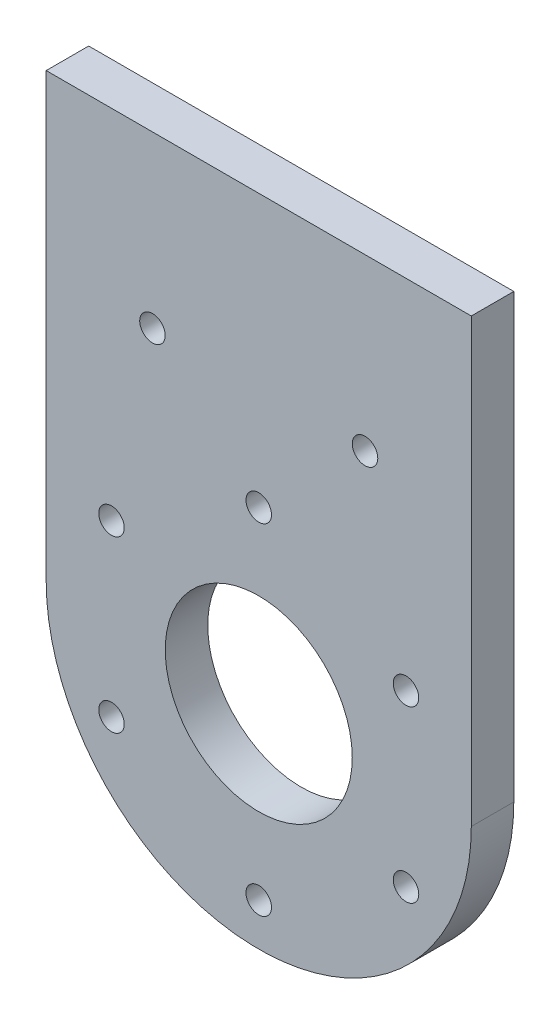
ISO-10303-21;
HEADER;
FILE_DESCRIPTION(('STEP AP214'),'2;1');
FILE_NAME('part.step','',(''),(''),'','','');
FILE_SCHEMA(('AUTOMOTIVE_DESIGN { 1 0 10303 214 1 1 1 1 }'));
ENDSEC;
DATA;
#1=APPLICATION_CONTEXT('core data for automotive mechanical design processes');
#2=APPLICATION_PROTOCOL_DEFINITION('international standard','automotive_design',2000,#1);
#3=PRODUCT_CONTEXT('',#1,'mechanical');
#4=PRODUCT('Part','Part','',(#3));
#5=PRODUCT_RELATED_PRODUCT_CATEGORY('part','',(#4));
#6=PRODUCT_DEFINITION_FORMATION('','',#4);
#7=PRODUCT_DEFINITION_CONTEXT('part definition',#1,'design');
#8=PRODUCT_DEFINITION('design','',#6,#7);
#9=PRODUCT_DEFINITION_SHAPE('','',#8);
#10=(LENGTH_UNIT() NAMED_UNIT(*) SI_UNIT(.MILLI.,.METRE.));
#11=(NAMED_UNIT(*) PLANE_ANGLE_UNIT() SI_UNIT($,.RADIAN.));
#12=(NAMED_UNIT(*) SI_UNIT($,.STERADIAN.) SOLID_ANGLE_UNIT());
#13=UNCERTAINTY_MEASURE_WITH_UNIT(LENGTH_MEASURE(1.E-05),#10,'distance_accuracy_value','');
#14=(GEOMETRIC_REPRESENTATION_CONTEXT(3) GLOBAL_UNCERTAINTY_ASSIGNED_CONTEXT((#13)) GLOBAL_UNIT_ASSIGNED_CONTEXT((#10,
#11,#12)) REPRESENTATION_CONTEXT('',''));
#15=CARTESIAN_POINT('',(0.,0.,0.));
#16=DIRECTION('',(0.,0.,1.));
#17=DIRECTION('',(1.,0.,0.));
#18=AXIS2_PLACEMENT_3D('',#15,#16,#17);
#19=CARTESIAN_POINT('',(0.,52.,5.));
#20=DIRECTION('',(0.,1.,0.));
#21=DIRECTION('',(0.,0.,1.));
#22=AXIS2_PLACEMENT_3D('',#19,#20,#21);
#23=PLANE('',#22);
#24=DIRECTION('',(1.,0.,0.));
#25=VECTOR('',#24,1.);
#26=CARTESIAN_POINT('',(0.,52.,5.));
#27=LINE('',#26,#25);
#28=CARTESIAN_POINT('',(-25.,52.,5.));
#29=VERTEX_POINT('',#28);
#30=CARTESIAN_POINT('',(25.,52.,5.));
#31=VERTEX_POINT('',#30);
#32=EDGE_CURVE('E12',#29,#31,#27,.T.);
#33=ORIENTED_EDGE('',*,*,#32,.T.);
#34=DIRECTION('',(0.,0.,1.));
#35=VECTOR('',#34,1.);
#36=CARTESIAN_POINT('',(25.,52.,0.));
#37=LINE('',#36,#35);
#38=CARTESIAN_POINT('',(25.,52.,0.));
#39=VERTEX_POINT('',#38);
#40=EDGE_CURVE('E329',#39,#31,#37,.T.);
#41=ORIENTED_EDGE('',*,*,#40,.F.);
#42=DIRECTION('',(1.,0.,0.));
#43=VECTOR('',#42,1.);
#44=CARTESIAN_POINT('',(0.,52.,0.));
#45=LINE('',#44,#43);
#46=CARTESIAN_POINT('',(-25.,52.,0.));
#47=VERTEX_POINT('',#46);
#48=EDGE_CURVE('E258',#47,#39,#45,.T.);
#49=ORIENTED_EDGE('',*,*,#48,.F.);
#50=DIRECTION('',(0.,0.,1.));
#51=VECTOR('',#50,1.);
#52=CARTESIAN_POINT('',(-25.,52.,0.));
#53=LINE('',#52,#51);
#54=EDGE_CURVE('E271',#47,#29,#53,.T.);
#55=ORIENTED_EDGE('',*,*,#54,.T.);
#56=EDGE_LOOP('',(#33,#41,#49,#55));
#57=FACE_BOUND('',#56,.T.);
#58=ADVANCED_FACE('F254',(#57),#23,.T.);
#59=CARTESIAN_POINT('',(0.,0.,5.));
#60=DIRECTION('',(0.,0.,1.));
#61=DIRECTION('',(1.,0.,0.));
#62=AXIS2_PLACEMENT_3D('',#59,#60,#61);
#63=PLANE('',#62);
#64=CARTESIAN_POINT('',(17.3205080756901,-9.99999999999926,5.));
#65=DIRECTION('',(0.,0.,1.));
#66=DIRECTION('',(1.,0.,0.));
#67=AXIS2_PLACEMENT_3D('',#64,#65,#66);
#68=CIRCLE('',#67,1.50000000000181);
#69=CARTESIAN_POINT('',(18.8205080756919,-9.99999999999926,5.));
#70=VERTEX_POINT('',#69);
#71=EDGE_CURVE('E404',#70,#70,#68,.T.);
#72=ORIENTED_EDGE('',*,*,#71,.F.);
#73=EDGE_LOOP('',(#72));
#74=FACE_BOUND('',#73,.T.);
#75=CARTESIAN_POINT('',(-17.3205080756884,9.99999999999925,5.));
#76=DIRECTION('',(0.,0.,1.));
#77=DIRECTION('',(1.,0.,0.));
#78=AXIS2_PLACEMENT_3D('',#75,#76,#77);
#79=CIRCLE('',#78,1.50000000000181);
#80=CARTESIAN_POINT('',(-15.8205080756865,9.99999999999925,5.));
#81=VERTEX_POINT('',#80);
#82=EDGE_CURVE('E426',#81,#81,#79,.T.);
#83=ORIENTED_EDGE('',*,*,#82,.F.);
#84=EDGE_LOOP('',(#83));
#85=FACE_BOUND('',#84,.T.);
#86=CARTESIAN_POINT('',(-17.3205080756875,-10.0000000000007,5.));
#87=DIRECTION('',(0.,0.,1.));
#88=DIRECTION('',(1.,0.,0.));
#89=AXIS2_PLACEMENT_3D('',#86,#87,#88);
#90=CIRCLE('',#89,1.50000000000181);
#91=CARTESIAN_POINT('',(-15.8205080756857,-10.0000000000007,5.));
#92=VERTEX_POINT('',#91);
#93=EDGE_CURVE('E438',#92,#92,#90,.T.);
#94=ORIENTED_EDGE('',*,*,#93,.F.);
#95=EDGE_LOOP('',(#94));
#96=FACE_BOUND('',#95,.T.);
#97=CARTESIAN_POINT('',(1.70040397862765E-12,-20.,5.));
#98=DIRECTION('',(0.,0.,1.));
#99=DIRECTION('',(1.,0.,0.));
#100=AXIS2_PLACEMENT_3D('',#97,#98,#99);
#101=CIRCLE('',#100,1.50000000000181);
#102=CARTESIAN_POINT('',(1.50000000000351,-20.,5.));
#103=VERTEX_POINT('',#102);
#104=EDGE_CURVE('E324',#103,#103,#101,.T.);
#105=ORIENTED_EDGE('',*,*,#104,.F.);
#106=EDGE_LOOP('',(#105));
#107=FACE_BOUND('',#106,.T.);
#108=CARTESIAN_POINT('',(0.,20.,5.));
#109=DIRECTION('',(0.,0.,1.));
#110=DIRECTION('',(1.,0.,0.));
#111=AXIS2_PLACEMENT_3D('',#108,#109,#110);
#112=CIRCLE('',#111,1.50000000000181);
#113=CARTESIAN_POINT('',(1.50000000000181,20.,5.));
#114=VERTEX_POINT('',#113);
#115=EDGE_CURVE('E399',#114,#114,#112,.T.);
#116=ORIENTED_EDGE('',*,*,#115,.F.);
#117=EDGE_LOOP('',(#116));
#118=FACE_BOUND('',#117,.T.);
#119=CARTESIAN_POINT('',(17.3205080756892,10.0000000000007,5.));
#120=DIRECTION('',(0.,0.,1.));
#121=DIRECTION('',(1.,0.,0.));
#122=AXIS2_PLACEMENT_3D('',#119,#120,#121);
#123=CIRCLE('',#122,1.50000000000181);
#124=CARTESIAN_POINT('',(18.820508075691,10.0000000000007,5.));
#125=VERTEX_POINT('',#124);
#126=EDGE_CURVE('E406',#125,#125,#123,.T.);
#127=ORIENTED_EDGE('',*,*,#126,.F.);
#128=EDGE_LOOP('',(#127));
#129=FACE_BOUND('',#128,.T.);
#130=CARTESIAN_POINT('',(-12.5,32.,5.));
#131=DIRECTION('',(0.,0.,1.));
#132=DIRECTION('',(1.,0.,0.));
#133=AXIS2_PLACEMENT_3D('',#130,#131,#132);
#134=CIRCLE('',#133,1.5);
#135=CARTESIAN_POINT('',(-11.,32.,5.));
#136=VERTEX_POINT('',#135);
#137=EDGE_CURVE('E414',#136,#136,#134,.T.);
#138=ORIENTED_EDGE('',*,*,#137,.F.);
#139=EDGE_LOOP('',(#138));
#140=FACE_BOUND('',#139,.T.);
#141=CARTESIAN_POINT('',(12.5,32.,5.));
#142=DIRECTION('',(0.,0.,1.));
#143=DIRECTION('',(1.,0.,0.));
#144=AXIS2_PLACEMENT_3D('',#141,#142,#143);
#145=CIRCLE('',#144,1.5);
#146=CARTESIAN_POINT('',(14.,32.,5.));
#147=VERTEX_POINT('',#146);
#148=EDGE_CURVE('E420',#147,#147,#145,.T.);
#149=ORIENTED_EDGE('',*,*,#148,.F.);
#150=EDGE_LOOP('',(#149));
#151=FACE_BOUND('',#150,.T.);
#152=CARTESIAN_POINT('',(0.,0.,5.));
#153=DIRECTION('',(0.,0.,1.));
#154=DIRECTION('',(1.,0.,0.));
#155=AXIS2_PLACEMENT_3D('',#152,#153,#154);
#156=CIRCLE('',#155,11.);
#157=CARTESIAN_POINT('',(11.,0.,5.));
#158=VERTEX_POINT('',#157);
#159=EDGE_CURVE('E263',#158,#158,#156,.T.);
#160=ORIENTED_EDGE('',*,*,#159,.F.);
#161=EDGE_LOOP('',(#160));
#162=FACE_BOUND('',#161,.T.);
#163=CARTESIAN_POINT('',(0.,0.,5.));
#164=DIRECTION('',(0.,0.,1.));
#165=DIRECTION('',(1.,0.,0.));
#166=AXIS2_PLACEMENT_3D('',#163,#164,#165);
#167=CIRCLE('',#166,25.);
#168=CARTESIAN_POINT('',(-25.,0.,5.));
#169=VERTEX_POINT('',#168);
#170=CARTESIAN_POINT('',(25.,0.,5.));
#171=VERTEX_POINT('',#170);
#172=EDGE_CURVE('E303',#169,#171,#167,.T.);
#173=ORIENTED_EDGE('',*,*,#172,.T.);
#174=DIRECTION('',(0.,1.,0.));
#175=VECTOR('',#174,1.);
#176=CARTESIAN_POINT('',(25.,0.,5.));
#177=LINE('',#176,#175);
#178=EDGE_CURVE('E298',#171,#31,#177,.T.);
#179=ORIENTED_EDGE('',*,*,#178,.T.);
#180=ORIENTED_EDGE('',*,*,#32,.F.);
#181=DIRECTION('',(0.,1.,0.));
#182=VECTOR('',#181,1.);
#183=CARTESIAN_POINT('',(-25.,0.,5.));
#184=LINE('',#183,#182);
#185=EDGE_CURVE('E316',#169,#29,#184,.T.);
#186=ORIENTED_EDGE('',*,*,#185,.F.);
#187=EDGE_LOOP('',(#173,#179,#180,#186));
#188=FACE_BOUND('',#187,.T.);
#189=ADVANCED_FACE('F341',(#74,#85,#96,#107,#118,#129,#140,#151,#162,#188),#63,.T.);
#190=CARTESIAN_POINT('',(0.,0.,0.));
#191=DIRECTION('',(0.,0.,1.));
#192=DIRECTION('',(1.,0.,0.));
#193=AXIS2_PLACEMENT_3D('',#190,#191,#192);
#194=PLANE('',#193);
#195=CARTESIAN_POINT('',(17.3205080756901,-9.99999999999926,0.));
#196=DIRECTION('',(0.,0.,1.));
#197=DIRECTION('',(1.,0.,0.));
#198=AXIS2_PLACEMENT_3D('',#195,#196,#197);
#199=CIRCLE('',#198,1.50000000000181);
#200=CARTESIAN_POINT('',(18.8205080756919,-9.99999999999926,0.));
#201=VERTEX_POINT('',#200);
#202=EDGE_CURVE('E401',#201,#201,#199,.T.);
#203=ORIENTED_EDGE('',*,*,#202,.T.);
#204=EDGE_LOOP('',(#203));
#205=FACE_BOUND('',#204,.T.);
#206=CARTESIAN_POINT('',(-17.3205080756884,9.99999999999925,0.));
#207=DIRECTION('',(0.,0.,1.));
#208=DIRECTION('',(1.,0.,0.));
#209=AXIS2_PLACEMENT_3D('',#206,#207,#208);
#210=CIRCLE('',#209,1.50000000000181);
#211=CARTESIAN_POINT('',(-15.8205080756865,9.99999999999925,0.));
#212=VERTEX_POINT('',#211);
#213=EDGE_CURVE('E429',#212,#212,#210,.T.);
#214=ORIENTED_EDGE('',*,*,#213,.T.);
#215=EDGE_LOOP('',(#214));
#216=FACE_BOUND('',#215,.T.);
#217=CARTESIAN_POINT('',(-17.3205080756875,-10.0000000000007,0.));
#218=DIRECTION('',(0.,0.,1.));
#219=DIRECTION('',(1.,0.,0.));
#220=AXIS2_PLACEMENT_3D('',#217,#218,#219);
#221=CIRCLE('',#220,1.50000000000181);
#222=CARTESIAN_POINT('',(-15.8205080756857,-10.0000000000007,0.));
#223=VERTEX_POINT('',#222);
#224=EDGE_CURVE('E319',#223,#223,#221,.T.);
#225=ORIENTED_EDGE('',*,*,#224,.T.);
#226=EDGE_LOOP('',(#225));
#227=FACE_BOUND('',#226,.T.);
#228=CARTESIAN_POINT('',(1.70040397862765E-12,-20.,0.));
#229=DIRECTION('',(0.,0.,1.));
#230=DIRECTION('',(1.,0.,0.));
#231=AXIS2_PLACEMENT_3D('',#228,#229,#230);
#232=CIRCLE('',#231,1.50000000000181);
#233=CARTESIAN_POINT('',(1.50000000000351,-20.,0.));
#234=VERTEX_POINT('',#233);
#235=EDGE_CURVE('E436',#234,#234,#232,.T.);
#236=ORIENTED_EDGE('',*,*,#235,.T.);
#237=EDGE_LOOP('',(#236));
#238=FACE_BOUND('',#237,.T.);
#239=CARTESIAN_POINT('',(0.,20.,0.));
#240=DIRECTION('',(0.,0.,1.));
#241=DIRECTION('',(1.,0.,0.));
#242=AXIS2_PLACEMENT_3D('',#239,#240,#241);
#243=CIRCLE('',#242,1.50000000000181);
#244=CARTESIAN_POINT('',(1.50000000000181,20.,0.));
#245=VERTEX_POINT('',#244);
#246=EDGE_CURVE('E396',#245,#245,#243,.T.);
#247=ORIENTED_EDGE('',*,*,#246,.T.);
#248=EDGE_LOOP('',(#247));
#249=FACE_BOUND('',#248,.T.);
#250=CARTESIAN_POINT('',(17.3205080756892,10.0000000000007,0.));
#251=DIRECTION('',(0.,0.,1.));
#252=DIRECTION('',(1.,0.,0.));
#253=AXIS2_PLACEMENT_3D('',#250,#251,#252);
#254=CIRCLE('',#253,1.50000000000181);
#255=CARTESIAN_POINT('',(18.820508075691,10.0000000000007,0.));
#256=VERTEX_POINT('',#255);
#257=EDGE_CURVE('E411',#256,#256,#254,.T.);
#258=ORIENTED_EDGE('',*,*,#257,.T.);
#259=EDGE_LOOP('',(#258));
#260=FACE_BOUND('',#259,.T.);
#261=CARTESIAN_POINT('',(-12.5,32.,0.));
#262=DIRECTION('',(0.,0.,1.));
#263=DIRECTION('',(1.,0.,0.));
#264=AXIS2_PLACEMENT_3D('',#261,#262,#263);
#265=CIRCLE('',#264,1.5);
#266=CARTESIAN_POINT('',(-11.,32.,0.));
#267=VERTEX_POINT('',#266);
#268=EDGE_CURVE('E417',#267,#267,#265,.T.);
#269=ORIENTED_EDGE('',*,*,#268,.T.);
#270=EDGE_LOOP('',(#269));
#271=FACE_BOUND('',#270,.T.);
#272=CARTESIAN_POINT('',(12.5,32.,0.));
#273=DIRECTION('',(0.,0.,1.));
#274=DIRECTION('',(1.,0.,0.));
#275=AXIS2_PLACEMENT_3D('',#272,#273,#274);
#276=CIRCLE('',#275,1.5);
#277=CARTESIAN_POINT('',(14.,32.,0.));
#278=VERTEX_POINT('',#277);
#279=EDGE_CURVE('E423',#278,#278,#276,.T.);
#280=ORIENTED_EDGE('',*,*,#279,.T.);
#281=EDGE_LOOP('',(#280));
#282=FACE_BOUND('',#281,.T.);
#283=CARTESIAN_POINT('',(0.,0.,0.));
#284=DIRECTION('',(0.,0.,1.));
#285=DIRECTION('',(1.,0.,0.));
#286=AXIS2_PLACEMENT_3D('',#283,#284,#285);
#287=CIRCLE('',#286,11.);
#288=CARTESIAN_POINT('',(11.,0.,0.));
#289=VERTEX_POINT('',#288);
#290=EDGE_CURVE('E328',#289,#289,#287,.T.);
#291=ORIENTED_EDGE('',*,*,#290,.T.);
#292=EDGE_LOOP('',(#291));
#293=FACE_BOUND('',#292,.T.);
#294=DIRECTION('',(0.,1.,0.));
#295=VECTOR('',#294,1.);
#296=CARTESIAN_POINT('',(25.,0.,0.));
#297=LINE('',#296,#295);
#298=CARTESIAN_POINT('',(25.,0.,0.));
#299=VERTEX_POINT('',#298);
#300=EDGE_CURVE('E305',#299,#39,#297,.T.);
#301=ORIENTED_EDGE('',*,*,#300,.F.);
#302=CARTESIAN_POINT('',(0.,0.,0.));
#303=DIRECTION('',(0.,0.,1.));
#304=DIRECTION('',(1.,0.,0.));
#305=AXIS2_PLACEMENT_3D('',#302,#303,#304);
#306=CIRCLE('',#305,25.);
#307=CARTESIAN_POINT('',(-25.,0.,0.));
#308=VERTEX_POINT('',#307);
#309=EDGE_CURVE('E280',#308,#299,#306,.T.);
#310=ORIENTED_EDGE('',*,*,#309,.F.);
#311=DIRECTION('',(0.,1.,0.));
#312=VECTOR('',#311,1.);
#313=CARTESIAN_POINT('',(-25.,0.,0.));
#314=LINE('',#313,#312);
#315=EDGE_CURVE('E307',#308,#47,#314,.T.);
#316=ORIENTED_EDGE('',*,*,#315,.T.);
#317=ORIENTED_EDGE('',*,*,#48,.T.);
#318=EDGE_LOOP('',(#301,#310,#316,#317));
#319=FACE_BOUND('',#318,.T.);
#320=ADVANCED_FACE('F314',(#205,#216,#227,#238,#249,#260,#271,#282,#293,#319),#194,.F.);
#321=CARTESIAN_POINT('',(0.,0.,5.));
#322=DIRECTION('',(0.,0.,-1.));
#323=DIRECTION('',(-1.,0.,0.));
#324=AXIS2_PLACEMENT_3D('',#321,#322,#323);
#325=CYLINDRICAL_SURFACE('',#324,11.);
#326=ORIENTED_EDGE('',*,*,#159,.T.);
#327=EDGE_LOOP('',(#326));
#328=FACE_BOUND('',#327,.T.);
#329=ORIENTED_EDGE('',*,*,#290,.F.);
#330=EDGE_LOOP('',(#329));
#331=FACE_BOUND('',#330,.T.);
#332=ADVANCED_FACE('F256',(#328,#331),#325,.F.);
#333=CARTESIAN_POINT('',(0.,0.,0.));
#334=DIRECTION('',(0.,0.,1.));
#335=DIRECTION('',(1.,0.,0.));
#336=AXIS2_PLACEMENT_3D('',#333,#334,#335);
#337=CYLINDRICAL_SURFACE('',#336,25.);
#338=ORIENTED_EDGE('',*,*,#172,.F.);
#339=DIRECTION('',(0.,0.,1.));
#340=VECTOR('',#339,1.);
#341=CARTESIAN_POINT('',(-25.,0.,0.));
#342=LINE('',#341,#340);
#343=EDGE_CURVE('E300',#308,#169,#342,.T.);
#344=ORIENTED_EDGE('',*,*,#343,.F.);
#345=ORIENTED_EDGE('',*,*,#309,.T.);
#346=DIRECTION('',(0.,0.,1.));
#347=VECTOR('',#346,1.);
#348=CARTESIAN_POINT('',(25.,0.,0.));
#349=LINE('',#348,#347);
#350=EDGE_CURVE('E326',#299,#171,#349,.T.);
#351=ORIENTED_EDGE('',*,*,#350,.T.);
#352=EDGE_LOOP('',(#338,#344,#345,#351));
#353=FACE_BOUND('',#352,.T.);
#354=ADVANCED_FACE('F301',(#353),#337,.T.);
#355=CARTESIAN_POINT('',(25.,0.,0.));
#356=DIRECTION('',(1.,0.,0.));
#357=DIRECTION('',(0.,1.,0.));
#358=AXIS2_PLACEMENT_3D('',#355,#356,#357);
#359=PLANE('',#358);
#360=ORIENTED_EDGE('',*,*,#178,.F.);
#361=ORIENTED_EDGE('',*,*,#350,.F.);
#362=ORIENTED_EDGE('',*,*,#300,.T.);
#363=ORIENTED_EDGE('',*,*,#40,.T.);
#364=EDGE_LOOP('',(#360,#361,#362,#363));
#365=FACE_BOUND('',#364,.T.);
#366=ADVANCED_FACE('F339',(#365),#359,.T.);
#367=CARTESIAN_POINT('',(-25.,0.,0.));
#368=DIRECTION('',(1.,0.,0.));
#369=DIRECTION('',(0.,1.,0.));
#370=AXIS2_PLACEMENT_3D('',#367,#368,#369);
#371=PLANE('',#370);
#372=ORIENTED_EDGE('',*,*,#185,.T.);
#373=ORIENTED_EDGE('',*,*,#54,.F.);
#374=ORIENTED_EDGE('',*,*,#315,.F.);
#375=ORIENTED_EDGE('',*,*,#343,.T.);
#376=EDGE_LOOP('',(#372,#373,#374,#375));
#377=FACE_BOUND('',#376,.T.);
#378=ADVANCED_FACE('F308',(#377),#371,.F.);
#379=CARTESIAN_POINT('',(12.5,32.,0.));
#380=DIRECTION('',(0.,0.,1.));
#381=DIRECTION('',(1.,0.,0.));
#382=AXIS2_PLACEMENT_3D('',#379,#380,#381);
#383=CYLINDRICAL_SURFACE('',#382,1.5);
#384=ORIENTED_EDGE('',*,*,#279,.F.);
#385=EDGE_LOOP('',(#384));
#386=FACE_BOUND('',#385,.T.);
#387=ORIENTED_EDGE('',*,*,#148,.T.);
#388=EDGE_LOOP('',(#387));
#389=FACE_BOUND('',#388,.T.);
#390=ADVANCED_FACE('F358',(#386,#389),#383,.F.);
#391=CARTESIAN_POINT('',(-12.5,32.,0.));
#392=DIRECTION('',(0.,0.,1.));
#393=DIRECTION('',(1.,0.,0.));
#394=AXIS2_PLACEMENT_3D('',#391,#392,#393);
#395=CYLINDRICAL_SURFACE('',#394,1.5);
#396=ORIENTED_EDGE('',*,*,#268,.F.);
#397=EDGE_LOOP('',(#396));
#398=FACE_BOUND('',#397,.T.);
#399=ORIENTED_EDGE('',*,*,#137,.T.);
#400=EDGE_LOOP('',(#399));
#401=FACE_BOUND('',#400,.T.);
#402=ADVANCED_FACE('F380',(#398,#401),#395,.F.);
#403=CARTESIAN_POINT('',(17.3205080756892,10.0000000000007,0.));
#404=DIRECTION('',(0.,0.,1.));
#405=DIRECTION('',(1.,0.,0.));
#406=AXIS2_PLACEMENT_3D('',#403,#404,#405);
#407=CYLINDRICAL_SURFACE('',#406,1.50000000000181);
#408=ORIENTED_EDGE('',*,*,#257,.F.);
#409=EDGE_LOOP('',(#408));
#410=FACE_BOUND('',#409,.T.);
#411=ORIENTED_EDGE('',*,*,#126,.T.);
#412=EDGE_LOOP('',(#411));
#413=FACE_BOUND('',#412,.T.);
#414=ADVANCED_FACE('F384',(#410,#413),#407,.F.);
#415=CARTESIAN_POINT('',(0.,20.,0.));
#416=DIRECTION('',(0.,0.,1.));
#417=DIRECTION('',(1.,0.,0.));
#418=AXIS2_PLACEMENT_3D('',#415,#416,#417);
#419=CYLINDRICAL_SURFACE('',#418,1.50000000000181);
#420=ORIENTED_EDGE('',*,*,#246,.F.);
#421=EDGE_LOOP('',(#420));
#422=FACE_BOUND('',#421,.T.);
#423=ORIENTED_EDGE('',*,*,#115,.T.);
#424=EDGE_LOOP('',(#423));
#425=FACE_BOUND('',#424,.T.);
#426=ADVANCED_FACE('F369',(#422,#425),#419,.F.);
#427=CARTESIAN_POINT('',(1.70040397862765E-12,-20.,0.));
#428=DIRECTION('',(0.,0.,1.));
#429=DIRECTION('',(1.,0.,0.));
#430=AXIS2_PLACEMENT_3D('',#427,#428,#429);
#431=CYLINDRICAL_SURFACE('',#430,1.50000000000181);
#432=ORIENTED_EDGE('',*,*,#235,.F.);
#433=EDGE_LOOP('',(#432));
#434=FACE_BOUND('',#433,.T.);
#435=ORIENTED_EDGE('',*,*,#104,.T.);
#436=EDGE_LOOP('',(#435));
#437=FACE_BOUND('',#436,.T.);
#438=ADVANCED_FACE('F365',(#434,#437),#431,.F.);
#439=CARTESIAN_POINT('',(-17.3205080756875,-10.0000000000007,0.));
#440=DIRECTION('',(0.,0.,1.));
#441=DIRECTION('',(1.,0.,0.));
#442=AXIS2_PLACEMENT_3D('',#439,#440,#441);
#443=CYLINDRICAL_SURFACE('',#442,1.50000000000181);
#444=ORIENTED_EDGE('',*,*,#224,.F.);
#445=EDGE_LOOP('',(#444));
#446=FACE_BOUND('',#445,.T.);
#447=ORIENTED_EDGE('',*,*,#93,.T.);
#448=EDGE_LOOP('',(#447));
#449=FACE_BOUND('',#448,.T.);
#450=ADVANCED_FACE('F361',(#446,#449),#443,.F.);
#451=CARTESIAN_POINT('',(-17.3205080756884,9.99999999999925,0.));
#452=DIRECTION('',(0.,0.,1.));
#453=DIRECTION('',(1.,0.,0.));
#454=AXIS2_PLACEMENT_3D('',#451,#452,#453);
#455=CYLINDRICAL_SURFACE('',#454,1.50000000000181);
#456=ORIENTED_EDGE('',*,*,#213,.F.);
#457=EDGE_LOOP('',(#456));
#458=FACE_BOUND('',#457,.T.);
#459=ORIENTED_EDGE('',*,*,#82,.T.);
#460=EDGE_LOOP('',(#459));
#461=FACE_BOUND('',#460,.T.);
#462=ADVANCED_FACE('F364',(#458,#461),#455,.F.);
#463=CARTESIAN_POINT('',(17.3205080756901,-9.99999999999926,0.));
#464=DIRECTION('',(0.,0.,1.));
#465=DIRECTION('',(1.,0.,0.));
#466=AXIS2_PLACEMENT_3D('',#463,#464,#465);
#467=CYLINDRICAL_SURFACE('',#466,1.50000000000181);
#468=ORIENTED_EDGE('',*,*,#202,.F.);
#469=EDGE_LOOP('',(#468));
#470=FACE_BOUND('',#469,.T.);
#471=ORIENTED_EDGE('',*,*,#71,.T.);
#472=EDGE_LOOP('',(#471));
#473=FACE_BOUND('',#472,.T.);
#474=ADVANCED_FACE('F371',(#470,#473),#467,.F.);
#475=CLOSED_SHELL('',(#58,#189,#320,#332,#354,#366,#378,#390,#402,#414,#426,#438,#450,#462,#474));
#476=MANIFOLD_SOLID_BREP('B2',#475);
#477=ADVANCED_BREP_SHAPE_REPRESENTATION('',(#18,#476),#14);
#478=SHAPE_DEFINITION_REPRESENTATION(#9,#477);
ENDSEC;
END-ISO-10303-21;
